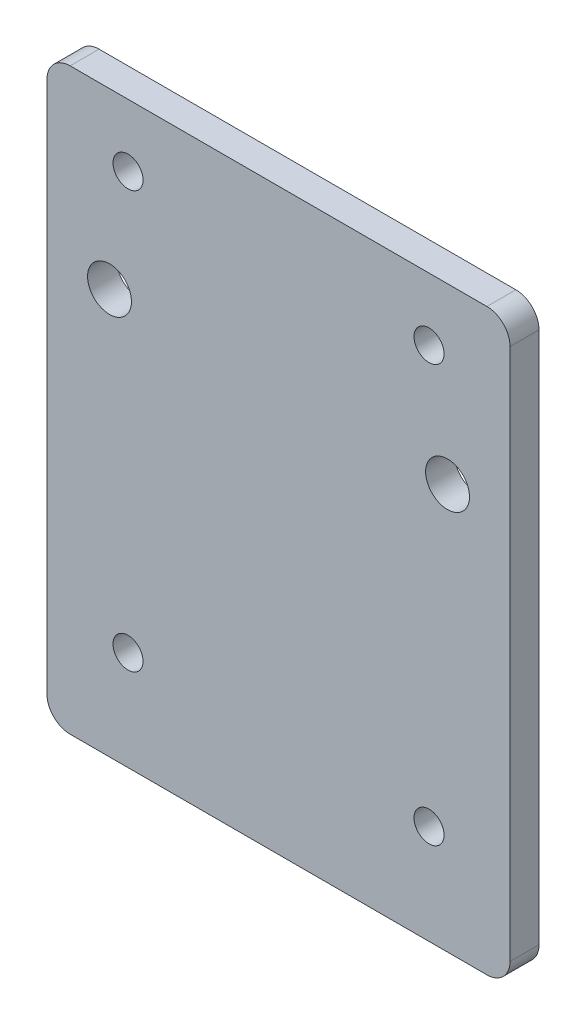
ISO-10303-21;
HEADER;
FILE_DESCRIPTION(('STEP AP214'),'2;1');
FILE_NAME('part.step','',(''),(''),'','','');
FILE_SCHEMA(('AUTOMOTIVE_DESIGN { 1 0 10303 214 1 1 1 1 }'));
ENDSEC;
DATA;
#1=APPLICATION_CONTEXT('core data for automotive mechanical design processes');
#2=APPLICATION_PROTOCOL_DEFINITION('international standard','automotive_design',2000,#1);
#3=PRODUCT_CONTEXT('',#1,'mechanical');
#4=PRODUCT('Part','Part','',(#3));
#5=PRODUCT_RELATED_PRODUCT_CATEGORY('part','',(#4));
#6=PRODUCT_DEFINITION_FORMATION('','',#4);
#7=PRODUCT_DEFINITION_CONTEXT('part definition',#1,'design');
#8=PRODUCT_DEFINITION('design','',#6,#7);
#9=PRODUCT_DEFINITION_SHAPE('','',#8);
#10=(LENGTH_UNIT() NAMED_UNIT(*) SI_UNIT(.MILLI.,.METRE.));
#11=(NAMED_UNIT(*) PLANE_ANGLE_UNIT() SI_UNIT($,.RADIAN.));
#12=(NAMED_UNIT(*) SI_UNIT($,.STERADIAN.) SOLID_ANGLE_UNIT());
#13=UNCERTAINTY_MEASURE_WITH_UNIT(LENGTH_MEASURE(1.E-05),#10,'distance_accuracy_value','');
#14=(GEOMETRIC_REPRESENTATION_CONTEXT(3) GLOBAL_UNCERTAINTY_ASSIGNED_CONTEXT((#13)) GLOBAL_UNIT_ASSIGNED_CONTEXT((#10,
#11,#12)) REPRESENTATION_CONTEXT('',''));
#15=CARTESIAN_POINT('',(0.,0.,0.));
#16=DIRECTION('',(0.,0.,1.));
#17=DIRECTION('',(1.,0.,0.));
#18=AXIS2_PLACEMENT_3D('',#15,#16,#17);
#19=CARTESIAN_POINT('',(0.,0.,0.));
#20=DIRECTION('',(0.,0.,1.));
#21=DIRECTION('',(1.,0.,0.));
#22=AXIS2_PLACEMENT_3D('',#19,#20,#21);
#23=PLANE('',#22);
#24=CARTESIAN_POINT('',(16.51,24.892,0.));
#25=DIRECTION('',(0.,0.,-1.));
#26=DIRECTION('',(-1.,0.,0.));
#27=AXIS2_PLACEMENT_3D('',#24,#25,#26);
#28=CIRCLE('',#27,1.6492);
#29=CARTESIAN_POINT('',(14.8608,24.892,0.));
#30=VERTEX_POINT('',#29);
#31=EDGE_CURVE('E210',#30,#30,#28,.T.);
#32=ORIENTED_EDGE('',*,*,#31,.F.);
#33=EDGE_LOOP('',(#32));
#34=FACE_BOUND('',#33,.T.);
#35=CARTESIAN_POINT('',(-16.51,-20.828,0.));
#36=DIRECTION('',(0.,0.,-1.));
#37=DIRECTION('',(-1.,0.,0.));
#38=AXIS2_PLACEMENT_3D('',#35,#36,#37);
#39=CIRCLE('',#38,1.6492);
#40=CARTESIAN_POINT('',(-18.1592,-20.828,0.));
#41=VERTEX_POINT('',#40);
#42=EDGE_CURVE('E192',#41,#41,#39,.T.);
#43=ORIENTED_EDGE('',*,*,#42,.F.);
#44=EDGE_LOOP('',(#43));
#45=FACE_BOUND('',#44,.T.);
#46=CARTESIAN_POINT('',(-18.542,12.7,0.));
#47=DIRECTION('',(0.,0.,-1.));
#48=DIRECTION('',(-1.,0.,0.));
#49=AXIS2_PLACEMENT_3D('',#46,#47,#48);
#50=CIRCLE('',#49,2.40665);
#51=CARTESIAN_POINT('',(-20.94865,12.7,0.));
#52=VERTEX_POINT('',#51);
#53=EDGE_CURVE('E134',#52,#52,#50,.T.);
#54=ORIENTED_EDGE('',*,*,#53,.F.);
#55=EDGE_LOOP('',(#54));
#56=FACE_BOUND('',#55,.T.);
#57=DIRECTION('',(0.,1.,0.));
#58=VECTOR('',#57,1.);
#59=CARTESIAN_POINT('',(25.4,31.75,0.));
#60=LINE('',#59,#58);
#61=CARTESIAN_POINT('',(25.4,-29.21,0.));
#62=VERTEX_POINT('',#61);
#63=CARTESIAN_POINT('',(25.4,29.21,0.));
#64=VERTEX_POINT('',#63);
#65=EDGE_CURVE('E118',#62,#64,#60,.T.);
#66=ORIENTED_EDGE('',*,*,#65,.F.);
#67=CARTESIAN_POINT('',(22.86,-29.21,0.));
#68=DIRECTION('',(0.,0.,1.));
#69=DIRECTION('',(1.,0.,0.));
#70=AXIS2_PLACEMENT_3D('',#67,#68,#69);
#71=CIRCLE('',#70,2.54);
#72=CARTESIAN_POINT('',(22.86,-31.75,0.));
#73=VERTEX_POINT('',#72);
#74=EDGE_CURVE('E101',#62,#73,#71,.F.);
#75=ORIENTED_EDGE('',*,*,#74,.T.);
#76=DIRECTION('',(1.,0.,0.));
#77=VECTOR('',#76,1.);
#78=CARTESIAN_POINT('',(-25.4,-31.75,0.));
#79=LINE('',#78,#77);
#80=CARTESIAN_POINT('',(-22.86,-31.75,0.));
#81=VERTEX_POINT('',#80);
#82=EDGE_CURVE('E141',#81,#73,#79,.T.);
#83=ORIENTED_EDGE('',*,*,#82,.F.);
#84=CARTESIAN_POINT('',(-22.86,-29.21,0.));
#85=DIRECTION('',(0.,0.,1.));
#86=DIRECTION('',(1.,0.,0.));
#87=AXIS2_PLACEMENT_3D('',#84,#85,#86);
#88=CIRCLE('',#87,2.54);
#89=CARTESIAN_POINT('',(-25.4,-29.21,0.));
#90=VERTEX_POINT('',#89);
#91=EDGE_CURVE('E112',#81,#90,#88,.F.);
#92=ORIENTED_EDGE('',*,*,#91,.T.);
#93=DIRECTION('',(0.,-1.,0.));
#94=VECTOR('',#93,1.);
#95=CARTESIAN_POINT('',(-25.4,31.75,0.));
#96=LINE('',#95,#94);
#97=CARTESIAN_POINT('',(-25.4,29.21,0.));
#98=VERTEX_POINT('',#97);
#99=EDGE_CURVE('E131',#98,#90,#96,.T.);
#100=ORIENTED_EDGE('',*,*,#99,.F.);
#101=CARTESIAN_POINT('',(-22.86,29.21,0.));
#102=DIRECTION('',(0.,0.,1.));
#103=DIRECTION('',(1.,0.,0.));
#104=AXIS2_PLACEMENT_3D('',#101,#102,#103);
#105=CIRCLE('',#104,2.54);
#106=CARTESIAN_POINT('',(-22.86,31.75,0.));
#107=VERTEX_POINT('',#106);
#108=EDGE_CURVE('E145',#98,#107,#105,.F.);
#109=ORIENTED_EDGE('',*,*,#108,.T.);
#110=DIRECTION('',(-1.,0.,0.));
#111=VECTOR('',#110,1.);
#112=CARTESIAN_POINT('',(-25.4,31.75,0.));
#113=LINE('',#112,#111);
#114=CARTESIAN_POINT('',(22.86,31.75,0.));
#115=VERTEX_POINT('',#114);
#116=EDGE_CURVE('E127',#115,#107,#113,.T.);
#117=ORIENTED_EDGE('',*,*,#116,.F.);
#118=CARTESIAN_POINT('',(22.86,29.21,0.));
#119=DIRECTION('',(0.,0.,1.));
#120=DIRECTION('',(1.,0.,0.));
#121=AXIS2_PLACEMENT_3D('',#118,#119,#120);
#122=CIRCLE('',#121,2.54);
#123=EDGE_CURVE('E122',#115,#64,#122,.F.);
#124=ORIENTED_EDGE('',*,*,#123,.T.);
#125=EDGE_LOOP('',(#66,#75,#83,#92,#100,#109,#117,#124));
#126=FACE_BOUND('',#125,.T.);
#127=CARTESIAN_POINT('',(18.542,12.7,0.));
#128=DIRECTION('',(0.,0.,-1.));
#129=DIRECTION('',(-1.,0.,0.));
#130=AXIS2_PLACEMENT_3D('',#127,#128,#129);
#131=CIRCLE('',#130,2.40665);
#132=CARTESIAN_POINT('',(16.13535,12.7,0.));
#133=VERTEX_POINT('',#132);
#134=EDGE_CURVE('E186',#133,#133,#131,.T.);
#135=ORIENTED_EDGE('',*,*,#134,.F.);
#136=EDGE_LOOP('',(#135));
#137=FACE_BOUND('',#136,.T.);
#138=CARTESIAN_POINT('',(16.51,-20.828,0.));
#139=DIRECTION('',(0.,0.,-1.));
#140=DIRECTION('',(-1.,0.,0.));
#141=AXIS2_PLACEMENT_3D('',#138,#139,#140);
#142=CIRCLE('',#141,1.6492);
#143=CARTESIAN_POINT('',(14.8608,-20.828,0.));
#144=VERTEX_POINT('',#143);
#145=EDGE_CURVE('E198',#144,#144,#142,.T.);
#146=ORIENTED_EDGE('',*,*,#145,.F.);
#147=EDGE_LOOP('',(#146));
#148=FACE_BOUND('',#147,.T.);
#149=CARTESIAN_POINT('',(-16.51,24.892,0.));
#150=DIRECTION('',(0.,0.,-1.));
#151=DIRECTION('',(-1.,0.,0.));
#152=AXIS2_PLACEMENT_3D('',#149,#150,#151);
#153=CIRCLE('',#152,1.6492);
#154=CARTESIAN_POINT('',(-18.1592,24.892,0.));
#155=VERTEX_POINT('',#154);
#156=EDGE_CURVE('E204',#155,#155,#153,.T.);
#157=ORIENTED_EDGE('',*,*,#156,.F.);
#158=EDGE_LOOP('',(#157));
#159=FACE_BOUND('',#158,.T.);
#160=ADVANCED_FACE('F35',(#34,#45,#56,#126,#137,#148,#159),#23,.F.);
#161=CARTESIAN_POINT('',(25.4,31.75,3.175));
#162=DIRECTION('',(-1.,0.,0.));
#163=DIRECTION('',(0.,-1.,0.));
#164=AXIS2_PLACEMENT_3D('',#161,#162,#163);
#165=PLANE('',#164);
#166=DIRECTION('',(0.,1.,0.));
#167=VECTOR('',#166,1.);
#168=CARTESIAN_POINT('',(25.4,31.75,3.175));
#169=LINE('',#168,#167);
#170=CARTESIAN_POINT('',(25.4,-29.21,3.175));
#171=VERTEX_POINT('',#170);
#172=CARTESIAN_POINT('',(25.4,29.21,3.175));
#173=VERTEX_POINT('',#172);
#174=EDGE_CURVE('E121',#171,#173,#169,.T.);
#175=ORIENTED_EDGE('',*,*,#174,.F.);
#176=DIRECTION('',(0.,0.,-1.));
#177=VECTOR('',#176,1.);
#178=CARTESIAN_POINT('',(25.4,-29.21,3.175));
#179=LINE('',#178,#177);
#180=EDGE_CURVE('E105',#171,#62,#179,.T.);
#181=ORIENTED_EDGE('',*,*,#180,.T.);
#182=ORIENTED_EDGE('',*,*,#65,.T.);
#183=DIRECTION('',(0.,0.,-1.));
#184=VECTOR('',#183,1.);
#185=CARTESIAN_POINT('',(25.4,29.21,3.175));
#186=LINE('',#185,#184);
#187=EDGE_CURVE('E123',#64,#173,#186,.F.);
#188=ORIENTED_EDGE('',*,*,#187,.T.);
#189=EDGE_LOOP('',(#175,#181,#182,#188));
#190=FACE_BOUND('',#189,.T.);
#191=ADVANCED_FACE('F117',(#190),#165,.F.);
#192=CARTESIAN_POINT('',(-25.4,31.75,3.175));
#193=DIRECTION('',(0.,-1.,0.));
#194=DIRECTION('',(0.,0.,-1.));
#195=AXIS2_PLACEMENT_3D('',#192,#193,#194);
#196=PLANE('',#195);
#197=ORIENTED_EDGE('',*,*,#116,.T.);
#198=DIRECTION('',(0.,0.,-1.));
#199=VECTOR('',#198,1.);
#200=CARTESIAN_POINT('',(-22.86,31.75,3.175));
#201=LINE('',#200,#199);
#202=CARTESIAN_POINT('',(-22.86,31.75,3.175));
#203=VERTEX_POINT('',#202);
#204=EDGE_CURVE('E11',#107,#203,#201,.F.);
#205=ORIENTED_EDGE('',*,*,#204,.T.);
#206=DIRECTION('',(-1.,0.,0.));
#207=VECTOR('',#206,1.);
#208=CARTESIAN_POINT('',(-25.4,31.75,3.175));
#209=LINE('',#208,#207);
#210=CARTESIAN_POINT('',(22.86,31.75,3.175));
#211=VERTEX_POINT('',#210);
#212=EDGE_CURVE('E167',#211,#203,#209,.T.);
#213=ORIENTED_EDGE('',*,*,#212,.F.);
#214=DIRECTION('',(0.,0.,-1.));
#215=VECTOR('',#214,1.);
#216=CARTESIAN_POINT('',(22.86,31.75,3.175));
#217=LINE('',#216,#215);
#218=EDGE_CURVE('E43',#211,#115,#217,.T.);
#219=ORIENTED_EDGE('',*,*,#218,.T.);
#220=EDGE_LOOP('',(#197,#205,#213,#219));
#221=FACE_BOUND('',#220,.T.);
#222=ADVANCED_FACE('F165',(#221),#196,.F.);
#223=CARTESIAN_POINT('',(-25.4,31.75,3.175));
#224=DIRECTION('',(1.,0.,0.));
#225=DIRECTION('',(0.,1.,0.));
#226=AXIS2_PLACEMENT_3D('',#223,#224,#225);
#227=PLANE('',#226);
#228=ORIENTED_EDGE('',*,*,#99,.T.);
#229=DIRECTION('',(0.,0.,-1.));
#230=VECTOR('',#229,1.);
#231=CARTESIAN_POINT('',(-25.4,-29.21,3.175));
#232=LINE('',#231,#230);
#233=CARTESIAN_POINT('',(-25.4,-29.21,3.175));
#234=VERTEX_POINT('',#233);
#235=EDGE_CURVE('E50',#90,#234,#232,.F.);
#236=ORIENTED_EDGE('',*,*,#235,.T.);
#237=DIRECTION('',(0.,-1.,0.));
#238=VECTOR('',#237,1.);
#239=CARTESIAN_POINT('',(-25.4,31.75,3.175));
#240=LINE('',#239,#238);
#241=CARTESIAN_POINT('',(-25.4,29.21,3.175));
#242=VERTEX_POINT('',#241);
#243=EDGE_CURVE('E175',#242,#234,#240,.T.);
#244=ORIENTED_EDGE('',*,*,#243,.F.);
#245=DIRECTION('',(0.,0.,-1.));
#246=VECTOR('',#245,1.);
#247=CARTESIAN_POINT('',(-25.4,29.21,3.175));
#248=LINE('',#247,#246);
#249=EDGE_CURVE('E158',#242,#98,#248,.T.);
#250=ORIENTED_EDGE('',*,*,#249,.T.);
#251=EDGE_LOOP('',(#228,#236,#244,#250));
#252=FACE_BOUND('',#251,.T.);
#253=ADVANCED_FACE('F174',(#252),#227,.F.);
#254=CARTESIAN_POINT('',(-25.4,-31.75,3.175));
#255=DIRECTION('',(0.,1.,0.));
#256=DIRECTION('',(0.,0.,1.));
#257=AXIS2_PLACEMENT_3D('',#254,#255,#256);
#258=PLANE('',#257);
#259=ORIENTED_EDGE('',*,*,#82,.T.);
#260=DIRECTION('',(0.,0.,-1.));
#261=VECTOR('',#260,1.);
#262=CARTESIAN_POINT('',(22.86,-31.75,3.175));
#263=LINE('',#262,#261);
#264=CARTESIAN_POINT('',(22.86,-31.75,3.175));
#265=VERTEX_POINT('',#264);
#266=EDGE_CURVE('E106',#73,#265,#263,.F.);
#267=ORIENTED_EDGE('',*,*,#266,.T.);
#268=DIRECTION('',(1.,0.,0.));
#269=VECTOR('',#268,1.);
#270=CARTESIAN_POINT('',(-25.4,-31.75,3.175));
#271=LINE('',#270,#269);
#272=CARTESIAN_POINT('',(-22.86,-31.75,3.175));
#273=VERTEX_POINT('',#272);
#274=EDGE_CURVE('E137',#273,#265,#271,.T.);
#275=ORIENTED_EDGE('',*,*,#274,.F.);
#276=DIRECTION('',(0.,0.,-1.));
#277=VECTOR('',#276,1.);
#278=CARTESIAN_POINT('',(-22.86,-31.75,3.175));
#279=LINE('',#278,#277);
#280=EDGE_CURVE('E111',#273,#81,#279,.T.);
#281=ORIENTED_EDGE('',*,*,#280,.T.);
#282=EDGE_LOOP('',(#259,#267,#275,#281));
#283=FACE_BOUND('',#282,.T.);
#284=ADVANCED_FACE('F233',(#283),#258,.F.);
#285=CARTESIAN_POINT('',(0.,0.,3.175));
#286=DIRECTION('',(0.,0.,1.));
#287=DIRECTION('',(1.,0.,0.));
#288=AXIS2_PLACEMENT_3D('',#285,#286,#287);
#289=PLANE('',#288);
#290=CARTESIAN_POINT('',(16.51,24.892,3.175));
#291=DIRECTION('',(0.,0.,1.));
#292=DIRECTION('',(1.,0.,0.));
#293=AXIS2_PLACEMENT_3D('',#290,#291,#292);
#294=CIRCLE('',#293,1.6492);
#295=CARTESIAN_POINT('',(18.1592,24.892,3.175));
#296=VERTEX_POINT('',#295);
#297=EDGE_CURVE('E207',#296,#296,#294,.T.);
#298=ORIENTED_EDGE('',*,*,#297,.F.);
#299=EDGE_LOOP('',(#298));
#300=FACE_BOUND('',#299,.T.);
#301=CARTESIAN_POINT('',(-16.51,24.892,3.175));
#302=DIRECTION('',(0.,0.,1.));
#303=DIRECTION('',(1.,0.,0.));
#304=AXIS2_PLACEMENT_3D('',#301,#302,#303);
#305=CIRCLE('',#304,1.6492);
#306=CARTESIAN_POINT('',(-14.8608,24.892,3.175));
#307=VERTEX_POINT('',#306);
#308=EDGE_CURVE('E201',#307,#307,#305,.T.);
#309=ORIENTED_EDGE('',*,*,#308,.F.);
#310=EDGE_LOOP('',(#309));
#311=FACE_BOUND('',#310,.T.);
#312=CARTESIAN_POINT('',(16.51,-20.828,3.175));
#313=DIRECTION('',(0.,0.,1.));
#314=DIRECTION('',(1.,0.,0.));
#315=AXIS2_PLACEMENT_3D('',#312,#313,#314);
#316=CIRCLE('',#315,1.6492);
#317=CARTESIAN_POINT('',(18.1592,-20.828,3.175));
#318=VERTEX_POINT('',#317);
#319=EDGE_CURVE('E195',#318,#318,#316,.T.);
#320=ORIENTED_EDGE('',*,*,#319,.F.);
#321=EDGE_LOOP('',(#320));
#322=FACE_BOUND('',#321,.T.);
#323=CARTESIAN_POINT('',(-16.51,-20.828,3.175));
#324=DIRECTION('',(0.,0.,1.));
#325=DIRECTION('',(1.,0.,0.));
#326=AXIS2_PLACEMENT_3D('',#323,#324,#325);
#327=CIRCLE('',#326,1.6492);
#328=CARTESIAN_POINT('',(-14.8608,-20.828,3.175));
#329=VERTEX_POINT('',#328);
#330=EDGE_CURVE('E189',#329,#329,#327,.T.);
#331=ORIENTED_EDGE('',*,*,#330,.F.);
#332=EDGE_LOOP('',(#331));
#333=FACE_BOUND('',#332,.T.);
#334=CARTESIAN_POINT('',(18.542,12.7,3.175));
#335=DIRECTION('',(0.,0.,1.));
#336=DIRECTION('',(1.,0.,0.));
#337=AXIS2_PLACEMENT_3D('',#334,#335,#336);
#338=CIRCLE('',#337,2.40665);
#339=CARTESIAN_POINT('',(20.94865,12.7,3.175));
#340=VERTEX_POINT('',#339);
#341=EDGE_CURVE('E183',#340,#340,#338,.T.);
#342=ORIENTED_EDGE('',*,*,#341,.F.);
#343=EDGE_LOOP('',(#342));
#344=FACE_BOUND('',#343,.T.);
#345=CARTESIAN_POINT('',(-18.542,12.7,3.175));
#346=DIRECTION('',(0.,0.,1.));
#347=DIRECTION('',(1.,0.,0.));
#348=AXIS2_PLACEMENT_3D('',#345,#346,#347);
#349=CIRCLE('',#348,2.40665);
#350=CARTESIAN_POINT('',(-16.13535,12.7,3.175));
#351=VERTEX_POINT('',#350);
#352=EDGE_CURVE('E128',#351,#351,#349,.T.);
#353=ORIENTED_EDGE('',*,*,#352,.F.);
#354=EDGE_LOOP('',(#353));
#355=FACE_BOUND('',#354,.T.);
#356=ORIENTED_EDGE('',*,*,#274,.T.);
#357=CARTESIAN_POINT('',(22.86,-29.21,3.175));
#358=DIRECTION('',(0.,0.,1.));
#359=DIRECTION('',(1.,0.,0.));
#360=AXIS2_PLACEMENT_3D('',#357,#358,#359);
#361=CIRCLE('',#360,2.54);
#362=EDGE_CURVE('E156',#265,#171,#361,.T.);
#363=ORIENTED_EDGE('',*,*,#362,.T.);
#364=ORIENTED_EDGE('',*,*,#174,.T.);
#365=CARTESIAN_POINT('',(22.86,29.21,3.175));
#366=DIRECTION('',(0.,0.,1.));
#367=DIRECTION('',(1.,0.,0.));
#368=AXIS2_PLACEMENT_3D('',#365,#366,#367);
#369=CIRCLE('',#368,2.54);
#370=EDGE_CURVE('E151',#173,#211,#369,.T.);
#371=ORIENTED_EDGE('',*,*,#370,.T.);
#372=ORIENTED_EDGE('',*,*,#212,.T.);
#373=CARTESIAN_POINT('',(-22.86,29.21,3.175));
#374=DIRECTION('',(0.,0.,1.));
#375=DIRECTION('',(1.,0.,0.));
#376=AXIS2_PLACEMENT_3D('',#373,#374,#375);
#377=CIRCLE('',#376,2.54);
#378=EDGE_CURVE('E57',#203,#242,#377,.T.);
#379=ORIENTED_EDGE('',*,*,#378,.T.);
#380=ORIENTED_EDGE('',*,*,#243,.T.);
#381=CARTESIAN_POINT('',(-22.86,-29.21,3.175));
#382=DIRECTION('',(0.,0.,1.));
#383=DIRECTION('',(1.,0.,0.));
#384=AXIS2_PLACEMENT_3D('',#381,#382,#383);
#385=CIRCLE('',#384,2.54);
#386=EDGE_CURVE('E154',#234,#273,#385,.T.);
#387=ORIENTED_EDGE('',*,*,#386,.T.);
#388=EDGE_LOOP('',(#356,#363,#364,#371,#372,#379,#380,#387));
#389=FACE_BOUND('',#388,.T.);
#390=ADVANCED_FACE('F228',(#300,#311,#322,#333,#344,#355,#389),#289,.T.);
#391=CARTESIAN_POINT('',(-18.542,12.7,0.));
#392=DIRECTION('',(0.,0.,-1.));
#393=DIRECTION('',(-1.,0.,0.));
#394=AXIS2_PLACEMENT_3D('',#391,#392,#393);
#395=CYLINDRICAL_SURFACE('',#394,2.40665);
#396=ORIENTED_EDGE('',*,*,#53,.T.);
#397=EDGE_LOOP('',(#396));
#398=FACE_BOUND('',#397,.T.);
#399=ORIENTED_EDGE('',*,*,#352,.T.);
#400=EDGE_LOOP('',(#399));
#401=FACE_BOUND('',#400,.T.);
#402=ADVANCED_FACE('F224',(#398,#401),#395,.F.);
#403=CARTESIAN_POINT('',(18.542,12.7,0.));
#404=DIRECTION('',(0.,0.,-1.));
#405=DIRECTION('',(-1.,0.,0.));
#406=AXIS2_PLACEMENT_3D('',#403,#404,#405);
#407=CYLINDRICAL_SURFACE('',#406,2.40665);
#408=ORIENTED_EDGE('',*,*,#134,.T.);
#409=EDGE_LOOP('',(#408));
#410=FACE_BOUND('',#409,.T.);
#411=ORIENTED_EDGE('',*,*,#341,.T.);
#412=EDGE_LOOP('',(#411));
#413=FACE_BOUND('',#412,.T.);
#414=ADVANCED_FACE('F227',(#410,#413),#407,.F.);
#415=CARTESIAN_POINT('',(-16.51,-20.828,0.));
#416=DIRECTION('',(0.,0.,-1.));
#417=DIRECTION('',(-1.,0.,0.));
#418=AXIS2_PLACEMENT_3D('',#415,#416,#417);
#419=CYLINDRICAL_SURFACE('',#418,1.6492);
#420=ORIENTED_EDGE('',*,*,#42,.T.);
#421=EDGE_LOOP('',(#420));
#422=FACE_BOUND('',#421,.T.);
#423=ORIENTED_EDGE('',*,*,#330,.T.);
#424=EDGE_LOOP('',(#423));
#425=FACE_BOUND('',#424,.T.);
#426=ADVANCED_FACE('F259',(#422,#425),#419,.F.);
#427=CARTESIAN_POINT('',(16.51,-20.828,0.));
#428=DIRECTION('',(0.,0.,-1.));
#429=DIRECTION('',(-1.,0.,0.));
#430=AXIS2_PLACEMENT_3D('',#427,#428,#429);
#431=CYLINDRICAL_SURFACE('',#430,1.6492);
#432=ORIENTED_EDGE('',*,*,#145,.T.);
#433=EDGE_LOOP('',(#432));
#434=FACE_BOUND('',#433,.T.);
#435=ORIENTED_EDGE('',*,*,#319,.T.);
#436=EDGE_LOOP('',(#435));
#437=FACE_BOUND('',#436,.T.);
#438=ADVANCED_FACE('F263',(#434,#437),#431,.F.);
#439=CARTESIAN_POINT('',(-16.51,24.892,0.));
#440=DIRECTION('',(0.,0.,-1.));
#441=DIRECTION('',(-1.,0.,0.));
#442=AXIS2_PLACEMENT_3D('',#439,#440,#441);
#443=CYLINDRICAL_SURFACE('',#442,1.6492);
#444=ORIENTED_EDGE('',*,*,#156,.T.);
#445=EDGE_LOOP('',(#444));
#446=FACE_BOUND('',#445,.T.);
#447=ORIENTED_EDGE('',*,*,#308,.T.);
#448=EDGE_LOOP('',(#447));
#449=FACE_BOUND('',#448,.T.);
#450=ADVANCED_FACE('F267',(#446,#449),#443,.F.);
#451=CARTESIAN_POINT('',(16.51,24.892,0.));
#452=DIRECTION('',(0.,0.,-1.));
#453=DIRECTION('',(-1.,0.,0.));
#454=AXIS2_PLACEMENT_3D('',#451,#452,#453);
#455=CYLINDRICAL_SURFACE('',#454,1.6492);
#456=ORIENTED_EDGE('',*,*,#31,.T.);
#457=EDGE_LOOP('',(#456));
#458=FACE_BOUND('',#457,.T.);
#459=ORIENTED_EDGE('',*,*,#297,.T.);
#460=EDGE_LOOP('',(#459));
#461=FACE_BOUND('',#460,.T.);
#462=ADVANCED_FACE('F214',(#458,#461),#455,.F.);
#463=CARTESIAN_POINT('',(22.86,-29.21,3.175));
#464=DIRECTION('',(0.,0.,-1.));
#465=DIRECTION('',(-1.,0.,0.));
#466=AXIS2_PLACEMENT_3D('',#463,#464,#465);
#467=CYLINDRICAL_SURFACE('',#466,2.54);
#468=ORIENTED_EDGE('',*,*,#362,.F.);
#469=ORIENTED_EDGE('',*,*,#266,.F.);
#470=ORIENTED_EDGE('',*,*,#74,.F.);
#471=ORIENTED_EDGE('',*,*,#180,.F.);
#472=EDGE_LOOP('',(#468,#469,#470,#471));
#473=FACE_BOUND('',#472,.T.);
#474=ADVANCED_FACE('F104',(#473),#467,.T.);
#475=CARTESIAN_POINT('',(-22.86,-29.21,3.175));
#476=DIRECTION('',(0.,0.,-1.));
#477=DIRECTION('',(-1.,0.,0.));
#478=AXIS2_PLACEMENT_3D('',#475,#476,#477);
#479=CYLINDRICAL_SURFACE('',#478,2.54);
#480=ORIENTED_EDGE('',*,*,#386,.F.);
#481=ORIENTED_EDGE('',*,*,#235,.F.);
#482=ORIENTED_EDGE('',*,*,#91,.F.);
#483=ORIENTED_EDGE('',*,*,#280,.F.);
#484=EDGE_LOOP('',(#480,#481,#482,#483));
#485=FACE_BOUND('',#484,.T.);
#486=ADVANCED_FACE('F240',(#485),#479,.T.);
#487=CARTESIAN_POINT('',(-22.86,29.21,3.175));
#488=DIRECTION('',(0.,0.,-1.));
#489=DIRECTION('',(-1.,0.,0.));
#490=AXIS2_PLACEMENT_3D('',#487,#488,#489);
#491=CYLINDRICAL_SURFACE('',#490,2.54);
#492=ORIENTED_EDGE('',*,*,#378,.F.);
#493=ORIENTED_EDGE('',*,*,#204,.F.);
#494=ORIENTED_EDGE('',*,*,#108,.F.);
#495=ORIENTED_EDGE('',*,*,#249,.F.);
#496=EDGE_LOOP('',(#492,#493,#494,#495));
#497=FACE_BOUND('',#496,.T.);
#498=ADVANCED_FACE('F173',(#497),#491,.T.);
#499=CARTESIAN_POINT('',(22.86,29.21,3.175));
#500=DIRECTION('',(0.,0.,-1.));
#501=DIRECTION('',(-1.,0.,0.));
#502=AXIS2_PLACEMENT_3D('',#499,#500,#501);
#503=CYLINDRICAL_SURFACE('',#502,2.54);
#504=ORIENTED_EDGE('',*,*,#370,.F.);
#505=ORIENTED_EDGE('',*,*,#187,.F.);
#506=ORIENTED_EDGE('',*,*,#123,.F.);
#507=ORIENTED_EDGE('',*,*,#218,.F.);
#508=EDGE_LOOP('',(#504,#505,#506,#507));
#509=FACE_BOUND('',#508,.T.);
#510=ADVANCED_FACE('F37',(#509),#503,.T.);
#511=CLOSED_SHELL('',(#160,#191,#222,#253,#284,#390,#402,#414,#426,#438,#450,#462,#474,#486,
#498,#510));
#512=MANIFOLD_SOLID_BREP('B2',#511);
#513=ADVANCED_BREP_SHAPE_REPRESENTATION('',(#18,#512),#14);
#514=SHAPE_DEFINITION_REPRESENTATION(#9,#513);
ENDSEC;
END-ISO-10303-21;
